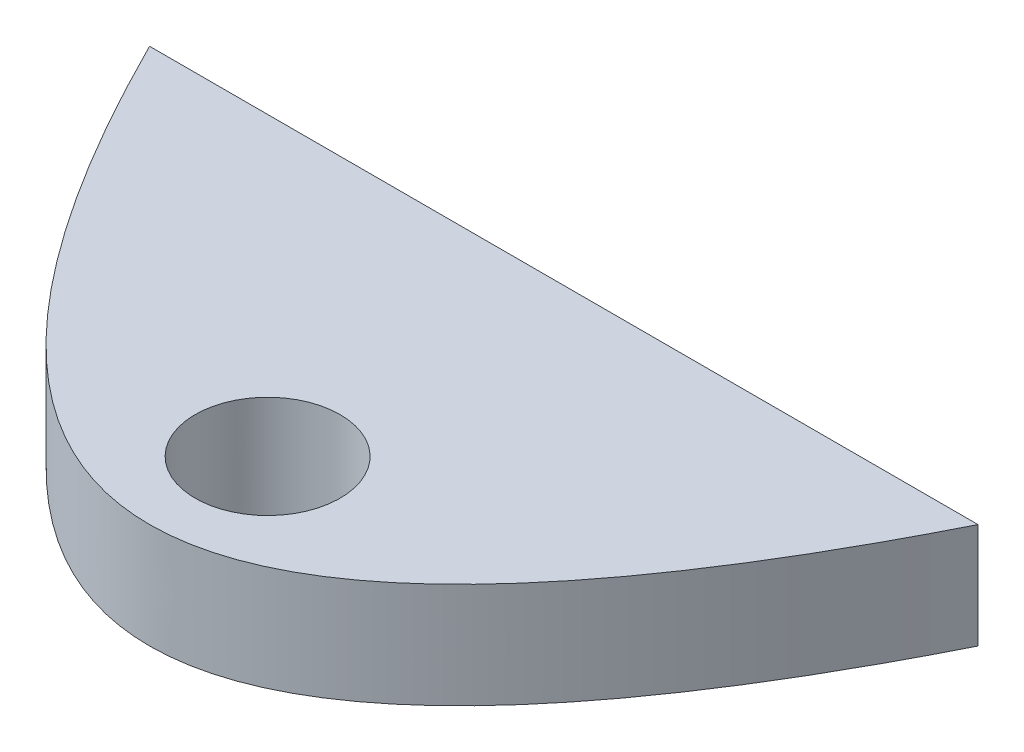
ISO-10303-21;
HEADER;
FILE_DESCRIPTION(('STEP AP214'),'2;1');
FILE_NAME('part.step','',(''),(''),'','','');
FILE_SCHEMA(('AUTOMOTIVE_DESIGN { 1 0 10303 214 1 1 1 1 }'));
ENDSEC;
DATA;
#1=APPLICATION_CONTEXT('core data for automotive mechanical design processes');
#2=APPLICATION_PROTOCOL_DEFINITION('international standard','automotive_design',2000,#1);
#3=PRODUCT_CONTEXT('',#1,'mechanical');
#4=PRODUCT('Part','Part','',(#3));
#5=PRODUCT_RELATED_PRODUCT_CATEGORY('part','',(#4));
#6=PRODUCT_DEFINITION_FORMATION('','',#4);
#7=PRODUCT_DEFINITION_CONTEXT('part definition',#1,'design');
#8=PRODUCT_DEFINITION('design','',#6,#7);
#9=PRODUCT_DEFINITION_SHAPE('','',#8);
#10=(LENGTH_UNIT() NAMED_UNIT(*) SI_UNIT(.MILLI.,.METRE.));
#11=(NAMED_UNIT(*) PLANE_ANGLE_UNIT() SI_UNIT($,.RADIAN.));
#12=(NAMED_UNIT(*) SI_UNIT($,.STERADIAN.) SOLID_ANGLE_UNIT());
#13=UNCERTAINTY_MEASURE_WITH_UNIT(LENGTH_MEASURE(1.E-05),#10,'distance_accuracy_value','');
#14=(GEOMETRIC_REPRESENTATION_CONTEXT(3) GLOBAL_UNCERTAINTY_ASSIGNED_CONTEXT((#13)) GLOBAL_UNIT_ASSIGNED_CONTEXT((#10,
#11,#12)) REPRESENTATION_CONTEXT('',''));
#15=CARTESIAN_POINT('',(0.,0.,0.));
#16=DIRECTION('',(0.,0.,1.));
#17=DIRECTION('',(1.,0.,0.));
#18=AXIS2_PLACEMENT_3D('',#15,#16,#17);
#19=CARTESIAN_POINT('',(0.,473.,142.999999999465));
#20=DIRECTION('',(0.,-1.,0.));
#21=DIRECTION('',(0.,0.,-1.));
#22=AXIS2_PLACEMENT_3D('',#19,#20,#21);
#23=CYLINDRICAL_SURFACE('',#22,35.);
#24=CARTESIAN_POINT('',(0.,198.4,142.999999999465));
#25=DIRECTION('',(0.,1.,0.));
#26=DIRECTION('',(0.,0.,1.));
#27=AXIS2_PLACEMENT_3D('',#24,#25,#26);
#28=CIRCLE('',#27,35.);
#29=CARTESIAN_POINT('',(0.,198.4,177.999999999465));
#30=VERTEX_POINT('',#29);
#31=EDGE_CURVE('E66',#30,#30,#28,.T.);
#32=ORIENTED_EDGE('',*,*,#31,.F.);
#33=EDGE_LOOP('',(#32));
#34=FACE_BOUND('',#33,.T.);
#35=CARTESIAN_POINT('',(0.,249.2,142.999999999465));
#36=DIRECTION('',(0.,-1.,0.));
#37=DIRECTION('',(0.,0.,-1.));
#38=AXIS2_PLACEMENT_3D('',#35,#36,#37);
#39=CIRCLE('',#38,35.);
#40=CARTESIAN_POINT('',(0.,249.2,107.999999999465));
#41=VERTEX_POINT('',#40);
#42=EDGE_CURVE('E75',#41,#41,#39,.T.);
#43=ORIENTED_EDGE('',*,*,#42,.F.);
#44=EDGE_LOOP('',(#43));
#45=FACE_BOUND('',#44,.T.);
#46=ADVANCED_FACE('F35',(#34,#45),#23,.F.);
#47=CARTESIAN_POINT('',(-200.000000000337,300.,-6.70196537155832E-10));
#48=CARTESIAN_POINT('',(-5.91540705308091E-11,300.,400.000000000552));
#49=CARTESIAN_POINT('',(200.000000000219,300.,-4.34305369445553E-10));
#50=B_SPLINE_CURVE_WITH_KNOTS('',2,(#47,#48,#49),.UNSPECIFIED.,.F.,.F.,(3,3),(0.056028396232078,
0.943971603767659),.UNSPECIFIED.);
#51=DIRECTION('',(0.,-1.,0.));
#52=VECTOR('',#51,1.);
#53=SURFACE_OF_LINEAR_EXTRUSION('',#50,#52);
#54=DIRECTION('',(0.,-1.,0.));
#55=VECTOR('',#54,1.);
#56=CARTESIAN_POINT('',(-200.00000000027,300.,-5.35238059385865E-10));
#57=LINE('',#56,#55);
#58=CARTESIAN_POINT('',(-200.00000000027,249.2,0.));
#59=VERTEX_POINT('',#58);
#60=CARTESIAN_POINT('',(-200.00000000027,198.4,-5.35238059385865E-10));
#61=VERTEX_POINT('',#60);
#62=EDGE_CURVE('E44',#59,#61,#57,.T.);
#63=ORIENTED_EDGE('',*,*,#62,.T.);
#64=CARTESIAN_POINT('',(-200.000000000337,198.4,-6.70196537155832E-10));
#65=CARTESIAN_POINT('',(-5.91540705308091E-11,198.4,400.000000000552));
#66=CARTESIAN_POINT('',(200.000000000219,198.4,-4.34305369445553E-10));
#67=B_SPLINE_CURVE_WITH_KNOTS('',2,(#64,#65,#66),.UNSPECIFIED.,.F.,.F.,(3,3),(0.056028396232078,
0.943971603767659),.UNSPECIFIED.);
#68=CARTESIAN_POINT('',(200.000000000156,198.4,0.));
#69=VERTEX_POINT('',#68);
#70=EDGE_CURVE('E50',#61,#69,#67,.T.);
#71=ORIENTED_EDGE('',*,*,#70,.T.);
#72=DIRECTION('',(0.,-1.,0.));
#73=VECTOR('',#72,1.);
#74=CARTESIAN_POINT('',(200.000000000156,300.,-5.35238059385865E-10));
#75=LINE('',#74,#73);
#76=CARTESIAN_POINT('',(200.000000000156,249.2,-5.35238059385865E-10));
#77=VERTEX_POINT('',#76);
#78=EDGE_CURVE('E11',#77,#69,#75,.T.);
#79=ORIENTED_EDGE('',*,*,#78,.F.);
#80=CARTESIAN_POINT('',(-200.000000000337,249.2,-6.70196537155832E-10));
#81=CARTESIAN_POINT('',(-5.91540705308091E-11,249.2,400.000000000552));
#82=CARTESIAN_POINT('',(200.000000000219,249.2,-4.34305369445553E-10));
#83=B_SPLINE_CURVE_WITH_KNOTS('',2,(#80,#81,#82),.UNSPECIFIED.,.F.,.F.,(3,3),(0.056028396232078,
0.943971603767659),.UNSPECIFIED.);
#84=EDGE_CURVE('E57',#77,#59,#83,.F.);
#85=ORIENTED_EDGE('',*,*,#84,.T.);
#86=EDGE_LOOP('',(#63,#71,#79,#85));
#87=FACE_BOUND('',#86,.T.);
#88=ADVANCED_FACE('F37',(#87),#53,.F.);
#89=CARTESIAN_POINT('',(-200.00000000027,300.,-5.35238059385865E-10));
#90=DIRECTION('',(0.,0.,1.));
#91=DIRECTION('',(1.,0.,0.));
#92=AXIS2_PLACEMENT_3D('',#89,#90,#91);
#93=PLANE('',#92);
#94=ORIENTED_EDGE('',*,*,#78,.T.);
#95=DIRECTION('',(1.,0.,0.));
#96=VECTOR('',#95,1.);
#97=CARTESIAN_POINT('',(252.256171121301,198.4,0.));
#98=LINE('',#97,#96);
#99=EDGE_CURVE('E67',#61,#69,#98,.T.);
#100=ORIENTED_EDGE('',*,*,#99,.F.);
#101=ORIENTED_EDGE('',*,*,#62,.F.);
#102=DIRECTION('',(-1.,0.,0.));
#103=VECTOR('',#102,1.);
#104=CARTESIAN_POINT('',(252.256171121301,249.2,0.));
#105=LINE('',#104,#103);
#106=EDGE_CURVE('E73',#77,#59,#105,.T.);
#107=ORIENTED_EDGE('',*,*,#106,.F.);
#108=EDGE_LOOP('',(#94,#100,#101,#107));
#109=FACE_BOUND('',#108,.T.);
#110=ADVANCED_FACE('F72',(#109),#93,.F.);
#111=CARTESIAN_POINT('',(252.256171121301,249.2,200.000000000059));
#112=DIRECTION('',(0.,-1.,0.));
#113=DIRECTION('',(0.,0.,-1.));
#114=AXIS2_PLACEMENT_3D('',#111,#112,#113);
#115=PLANE('',#114);
#116=ORIENTED_EDGE('',*,*,#42,.T.);
#117=EDGE_LOOP('',(#116));
#118=FACE_BOUND('',#117,.T.);
#119=ORIENTED_EDGE('',*,*,#106,.T.);
#120=ORIENTED_EDGE('',*,*,#84,.F.);
#121=EDGE_LOOP('',(#119,#120));
#122=FACE_BOUND('',#121,.T.);
#123=ADVANCED_FACE('F94',(#118,#122),#115,.F.);
#124=CARTESIAN_POINT('',(252.256171121301,198.4,200.000000000059));
#125=DIRECTION('',(0.,1.,0.));
#126=DIRECTION('',(0.,0.,1.));
#127=AXIS2_PLACEMENT_3D('',#124,#125,#126);
#128=PLANE('',#127);
#129=ORIENTED_EDGE('',*,*,#31,.T.);
#130=EDGE_LOOP('',(#129));
#131=FACE_BOUND('',#130,.T.);
#132=ORIENTED_EDGE('',*,*,#99,.T.);
#133=ORIENTED_EDGE('',*,*,#70,.F.);
#134=EDGE_LOOP('',(#132,#133));
#135=FACE_BOUND('',#134,.T.);
#136=ADVANCED_FACE('F69',(#131,#135),#128,.F.);
#137=CLOSED_SHELL('',(#46,#88,#110,#123,#136));
#138=MANIFOLD_SOLID_BREP('B2',#137);
#139=ADVANCED_BREP_SHAPE_REPRESENTATION('',(#18,#138),#14);
#140=SHAPE_DEFINITION_REPRESENTATION(#9,#139);
ENDSEC;
END-ISO-10303-21;
